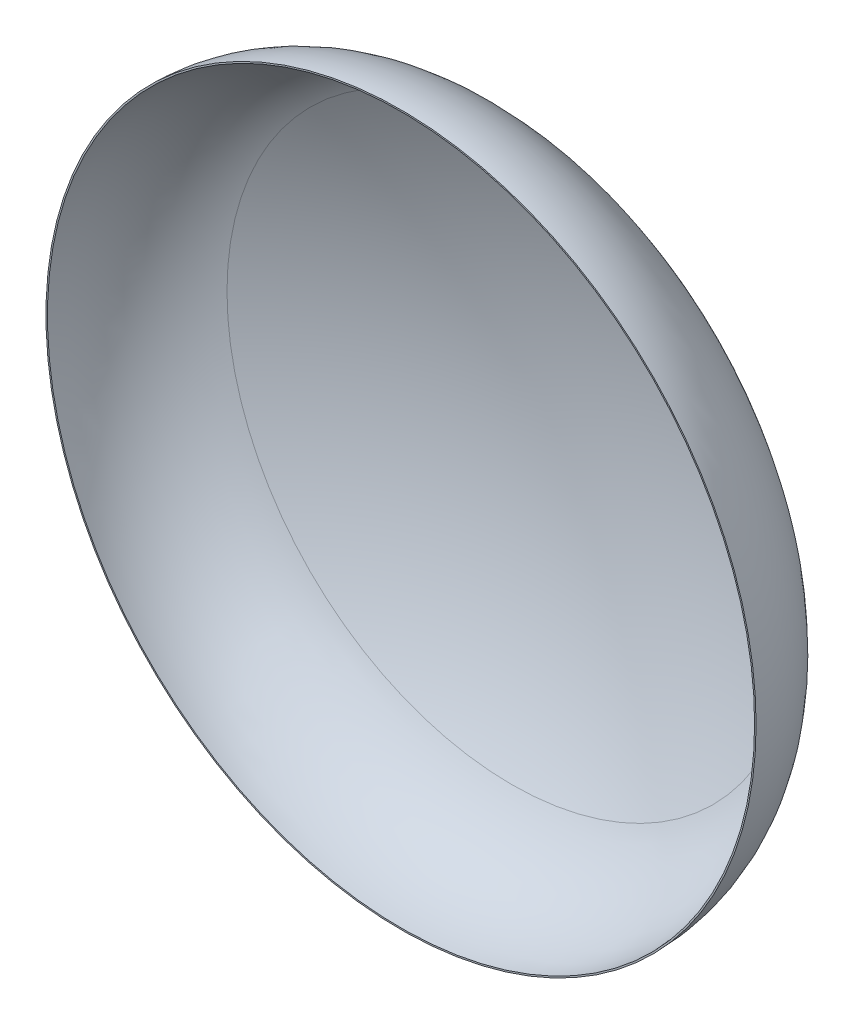
ISO-10303-21;
HEADER;
FILE_DESCRIPTION(('STEP AP214'),'2;1');
FILE_NAME('part.step','',(''),(''),'','','');
FILE_SCHEMA(('AUTOMOTIVE_DESIGN { 1 0 10303 214 1 1 1 1 }'));
ENDSEC;
DATA;
#1=APPLICATION_CONTEXT('core data for automotive mechanical design processes');
#2=APPLICATION_PROTOCOL_DEFINITION('international standard','automotive_design',2000,#1);
#3=PRODUCT_CONTEXT('',#1,'mechanical');
#4=PRODUCT('Part','Part','',(#3));
#5=PRODUCT_RELATED_PRODUCT_CATEGORY('part','',(#4));
#6=PRODUCT_DEFINITION_FORMATION('','',#4);
#7=PRODUCT_DEFINITION_CONTEXT('part definition',#1,'design');
#8=PRODUCT_DEFINITION('design','',#6,#7);
#9=PRODUCT_DEFINITION_SHAPE('','',#8);
#10=(LENGTH_UNIT() NAMED_UNIT(*) SI_UNIT(.MILLI.,.METRE.));
#11=(NAMED_UNIT(*) PLANE_ANGLE_UNIT() SI_UNIT($,.RADIAN.));
#12=(NAMED_UNIT(*) SI_UNIT($,.STERADIAN.) SOLID_ANGLE_UNIT());
#13=UNCERTAINTY_MEASURE_WITH_UNIT(LENGTH_MEASURE(1.E-05),#10,'distance_accuracy_value','');
#14=(GEOMETRIC_REPRESENTATION_CONTEXT(3) GLOBAL_UNCERTAINTY_ASSIGNED_CONTEXT((#13)) GLOBAL_UNIT_ASSIGNED_CONTEXT((#10,
#11,#12)) REPRESENTATION_CONTEXT('',''));
#15=CARTESIAN_POINT('',(0.,0.,0.));
#16=DIRECTION('',(0.,0.,1.));
#17=DIRECTION('',(1.,0.,0.));
#18=AXIS2_PLACEMENT_3D('',#15,#16,#17);
#19=CARTESIAN_POINT('',(4.90064183362153E-10,4.9004923088382E-10,957.429234483604));
#20=DIRECTION('',(0.,0.,1.));
#21=DIRECTION('',(0.,1.,0.));
#22=AXIS2_PLACEMENT_3D('',#19,#20,#21);
#23=SPHERICAL_SURFACE('',#22,1102.76386);
#24=CARTESIAN_POINT('',(4.90064183362153E-10,4.9004923088382E-10,-30.842251861177));
#25=DIRECTION('',(0.,0.,1.));
#26=DIRECTION('',(1.,0.,0.));
#27=AXIS2_PLACEMENT_3D('',#24,#25,#26);
#28=CIRCLE('',#27,489.292959483352);
#29=CARTESIAN_POINT('',(489.292959483842,4.9004923088382E-10,-30.842251861177));
#30=VERTEX_POINT('',#29);
#31=EDGE_CURVE('E65',#30,#30,#28,.T.);
#32=ORIENTED_EDGE('',*,*,#31,.T.);
#33=EDGE_LOOP('',(#32));
#34=FACE_BOUND('',#33,.T.);
#35=ADVANCED_FACE('F36',(#34),#23,.F.);
#36=CARTESIAN_POINT('',(4.90064183362153E-10,4.9004923088382E-10,957.429234483604));
#37=DIRECTION('',(0.,0.,1.));
#38=DIRECTION('',(0.,1.,0.));
#39=AXIS2_PLACEMENT_3D('',#36,#37,#38);
#40=SPHERICAL_SURFACE('',#39,1105.30894);
#41=CARTESIAN_POINT('',(4.90064183362153E-10,4.9004923088382E-10,-33.1230937401143));
#42=DIRECTION('',(0.,0.,1.));
#43=DIRECTION('',(1.,0.,0.));
#44=AXIS2_PLACEMENT_3D('',#41,#42,#43);
#45=CIRCLE('',#44,490.422203712775);
#46=CARTESIAN_POINT('',(490.422203713265,4.9004923088382E-10,-33.1230937401143));
#47=VERTEX_POINT('',#46);
#48=EDGE_CURVE('E56',#47,#47,#45,.T.);
#49=ORIENTED_EDGE('',*,*,#48,.F.);
#50=EDGE_LOOP('',(#49));
#51=FACE_BOUND('',#50,.T.);
#52=ADVANCED_FACE('F85',(#51),#40,.T.);
#53=CARTESIAN_POINT('',(4.90064183362153E-10,4.9004923088382E-10,159.462834483604));
#54=DIRECTION('',(0.,0.,1.));
#55=DIRECTION('',(1.,0.,0.));
#56=AXIS2_PLACEMENT_3D('',#53,#54,#55);
#57=TOROIDAL_SURFACE('',#56,395.072960030806,214.897226646867);
#58=CARTESIAN_POINT('',(4.90064183362153E-10,4.9004923088382E-10,159.465374483604));
#59=DIRECTION('',(0.,0.,1.));
#60=DIRECTION('',(1.,0.,0.));
#61=AXIS2_PLACEMENT_3D('',#58,#59,#60);
#62=CIRCLE('',#61,609.970186662661);
#63=CARTESIAN_POINT('',(609.970186663151,4.9004923088382E-10,159.465374483604));
#64=VERTEX_POINT('',#63);
#65=EDGE_CURVE('E59',#64,#64,#62,.T.);
#66=ORIENTED_EDGE('',*,*,#65,.F.);
#67=EDGE_LOOP('',(#66));
#68=FACE_BOUND('',#67,.T.);
#69=ORIENTED_EDGE('',*,*,#48,.T.);
#70=EDGE_LOOP('',(#69));
#71=FACE_BOUND('',#70,.T.);
#72=ADVANCED_FACE('F79',(#68,#71),#57,.T.);
#73=CARTESIAN_POINT('',(4.90064183362153E-10,609.967646678162,159.465374483604));
#74=DIRECTION('',(0.,0.,-1.));
#75=DIRECTION('',(-1.,0.,0.));
#76=AXIS2_PLACEMENT_3D('',#73,#74,#75);
#77=PLANE('',#76);
#78=CARTESIAN_POINT('',(4.90064183362153E-10,4.9004923088382E-10,159.465374483604));
#79=DIRECTION('',(0.,0.,1.));
#80=DIRECTION('',(1.,0.,0.));
#81=AXIS2_PLACEMENT_3D('',#78,#79,#80);
#82=CIRCLE('',#81,607.425106662481);
#83=CARTESIAN_POINT('',(607.425106662971,4.9004923088382E-10,159.465374483604));
#84=VERTEX_POINT('',#83);
#85=EDGE_CURVE('E62',#84,#84,#82,.T.);
#86=ORIENTED_EDGE('',*,*,#85,.F.);
#87=EDGE_LOOP('',(#86));
#88=FACE_BOUND('',#87,.T.);
#89=ORIENTED_EDGE('',*,*,#65,.T.);
#90=EDGE_LOOP('',(#89));
#91=FACE_BOUND('',#90,.T.);
#92=ADVANCED_FACE('F73',(#88,#91),#77,.F.);
#93=CARTESIAN_POINT('',(4.90064183362153E-10,4.9004923088382E-10,159.462834483604));
#94=DIRECTION('',(0.,0.,1.));
#95=DIRECTION('',(1.,0.,0.));
#96=AXIS2_PLACEMENT_3D('',#93,#94,#95);
#97=TOROIDAL_SURFACE('',#96,395.072960030806,212.352146646867);
#98=ORIENTED_EDGE('',*,*,#31,.F.);
#99=EDGE_LOOP('',(#98));
#100=FACE_BOUND('',#99,.T.);
#101=ORIENTED_EDGE('',*,*,#85,.T.);
#102=EDGE_LOOP('',(#101));
#103=FACE_BOUND('',#102,.T.);
#104=ADVANCED_FACE('F70',(#100,#103),#97,.F.);
#105=CLOSED_SHELL('',(#35,#52,#72,#92,#104));
#106=CARTESIAN_POINT('',(4.90064183362153E-10,4.9004923088382E-10,957.429234483604));
#107=DIRECTION('',(0.,0.,1.));
#108=DIRECTION('',(0.,1.,0.));
#109=AXIS2_PLACEMENT_3D('',#106,#107,#108);
#110=SPHERICAL_SURFACE('',#109,1102.7664);
#111=CARTESIAN_POINT('',(4.90064183362153E-10,4.9004923088382E-10,-30.8445281504774));
#112=DIRECTION('',(0.,0.,1.));
#113=DIRECTION('',(1.,0.,0.));
#114=AXIS2_PLACEMENT_3D('',#111,#112,#113);
#115=CIRCLE('',#114,489.294086473601);
#116=CARTESIAN_POINT('',(489.294086474091,4.9004923088382E-10,-30.8445281504774));
#117=VERTEX_POINT('',#116);
#118=EDGE_CURVE('E10',#117,#117,#115,.T.);
#119=ORIENTED_EDGE('',*,*,#118,.F.);
#120=EDGE_LOOP('',(#119));
#121=FACE_BOUND('',#120,.T.);
#122=ADVANCED_FACE('F109',(#121),#110,.T.);
#123=CARTESIAN_POINT('',(4.90064183362153E-10,4.9004923088382E-10,159.462834483604));
#124=DIRECTION('',(0.,0.,1.));
#125=DIRECTION('',(1.,0.,0.));
#126=AXIS2_PLACEMENT_3D('',#123,#124,#125);
#127=TOROIDAL_SURFACE('',#126,395.072960030806,212.354686646867);
#128=ORIENTED_EDGE('',*,*,#118,.T.);
#129=EDGE_LOOP('',(#128));
#130=FACE_BOUND('',#129,.T.);
#131=CARTESIAN_POINT('',(4.90064183362153E-10,4.9004923088382E-10,159.462834483604));
#132=DIRECTION('',(0.,0.,1.));
#133=DIRECTION('',(1.,0.,0.));
#134=AXIS2_PLACEMENT_3D('',#131,#132,#133);
#135=CIRCLE('',#134,607.427646677672);
#136=CARTESIAN_POINT('',(607.427646678162,4.9004923088382E-10,159.462834483604));
#137=VERTEX_POINT('',#136);
#138=EDGE_CURVE('E43',#137,#137,#135,.T.);
#139=ORIENTED_EDGE('',*,*,#138,.F.);
#140=EDGE_LOOP('',(#139));
#141=FACE_BOUND('',#140,.T.);
#142=ADVANCED_FACE('F107',(#130,#141),#127,.T.);
#143=CARTESIAN_POINT('',(4.90064183362153E-10,609.967646678162,159.462834483604));
#144=DIRECTION('',(0.,0.,-1.));
#145=DIRECTION('',(-1.,0.,0.));
#146=AXIS2_PLACEMENT_3D('',#143,#144,#145);
#147=PLANE('',#146);
#148=ORIENTED_EDGE('',*,*,#138,.T.);
#149=EDGE_LOOP('',(#148));
#150=FACE_BOUND('',#149,.T.);
#151=CARTESIAN_POINT('',(4.90064183362153E-10,4.9004923088382E-10,159.462834483604));
#152=DIRECTION('',(0.,0.,1.));
#153=DIRECTION('',(1.,0.,0.));
#154=AXIS2_PLACEMENT_3D('',#151,#152,#153);
#155=CIRCLE('',#154,609.967646677672);
#156=CARTESIAN_POINT('',(609.967646678162,4.9004923088382E-10,159.462834483604));
#157=VERTEX_POINT('',#156);
#158=EDGE_CURVE('E47',#157,#157,#155,.T.);
#159=ORIENTED_EDGE('',*,*,#158,.F.);
#160=EDGE_LOOP('',(#159));
#161=FACE_BOUND('',#160,.T.);
#162=ADVANCED_FACE('F103',(#150,#161),#147,.T.);
#163=CARTESIAN_POINT('',(4.90064183362153E-10,4.9004923088382E-10,159.462834483604));
#164=DIRECTION('',(0.,0.,1.));
#165=DIRECTION('',(1.,0.,0.));
#166=AXIS2_PLACEMENT_3D('',#163,#164,#165);
#167=TOROIDAL_SURFACE('',#166,395.072960030806,214.894686646867);
#168=ORIENTED_EDGE('',*,*,#158,.T.);
#169=EDGE_LOOP('',(#168));
#170=FACE_BOUND('',#169,.T.);
#171=CARTESIAN_POINT('',(4.90064183362153E-10,4.9004923088382E-10,-33.120817450814));
#172=DIRECTION('',(0.,0.,1.));
#173=DIRECTION('',(1.,0.,0.));
#174=AXIS2_PLACEMENT_3D('',#171,#172,#173);
#175=CIRCLE('',#174,490.421076722526);
#176=CARTESIAN_POINT('',(490.421076723016,4.9004923088382E-10,-33.120817450814));
#177=VERTEX_POINT('',#176);
#178=EDGE_CURVE('E51',#177,#177,#175,.T.);
#179=ORIENTED_EDGE('',*,*,#178,.F.);
#180=EDGE_LOOP('',(#179));
#181=FACE_BOUND('',#180,.T.);
#182=ADVANCED_FACE('F98',(#170,#181),#167,.F.);
#183=CARTESIAN_POINT('',(4.90064183362153E-10,4.9004923088382E-10,957.429234483604));
#184=DIRECTION('',(0.,0.,1.));
#185=DIRECTION('',(0.,1.,0.));
#186=AXIS2_PLACEMENT_3D('',#183,#184,#185);
#187=SPHERICAL_SURFACE('',#186,1105.3064);
#188=ORIENTED_EDGE('',*,*,#178,.T.);
#189=EDGE_LOOP('',(#188));
#190=FACE_BOUND('',#189,.T.);
#191=ADVANCED_FACE('F95',(#190),#187,.F.);
#192=CLOSED_SHELL('',(#122,#142,#162,#182,#191));
#193=ORIENTED_CLOSED_SHELL('',*,#192,.T.);
#194=BREP_WITH_VOIDS('B2',#105,(#193));
#195=ADVANCED_BREP_SHAPE_REPRESENTATION('',(#18,#194),#14);
#196=SHAPE_DEFINITION_REPRESENTATION(#9,#195);
ENDSEC;
END-ISO-10303-21;
